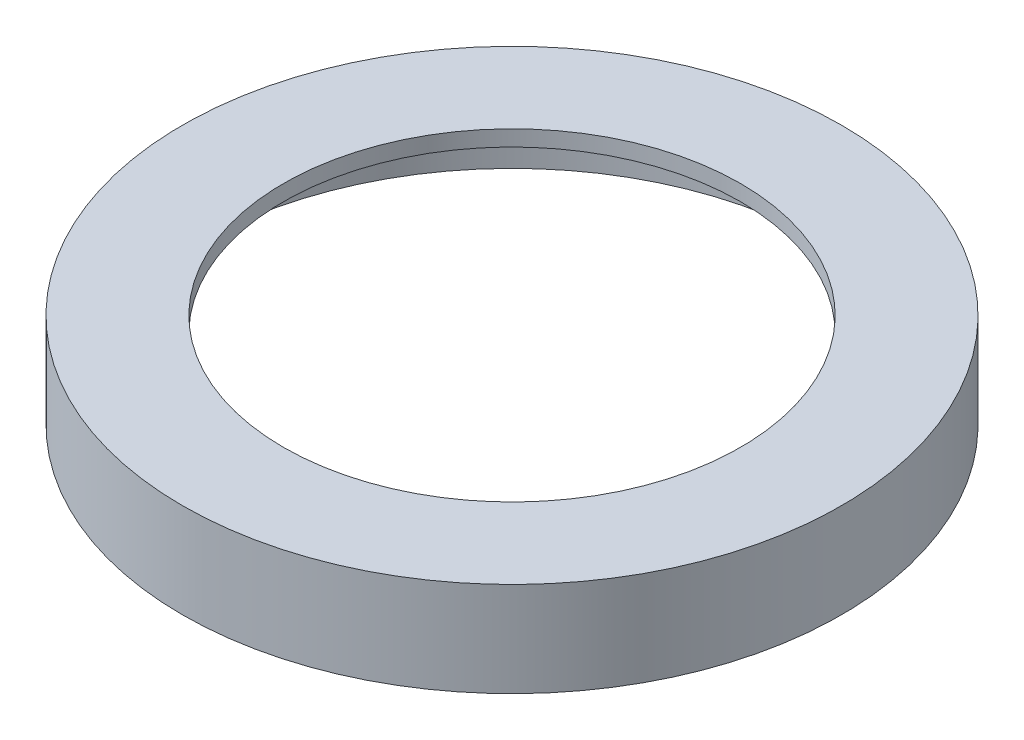
ISO-10303-21;
HEADER;
FILE_DESCRIPTION(('STEP AP214'),'2;1');
FILE_NAME('part.step','',(''),(''),'','','');
FILE_SCHEMA(('AUTOMOTIVE_DESIGN { 1 0 10303 214 1 1 1 1 }'));
ENDSEC;
DATA;
#1=APPLICATION_CONTEXT('core data for automotive mechanical design processes');
#2=APPLICATION_PROTOCOL_DEFINITION('international standard','automotive_design',2000,#1);
#3=PRODUCT_CONTEXT('',#1,'mechanical');
#4=PRODUCT('Part','Part','',(#3));
#5=PRODUCT_RELATED_PRODUCT_CATEGORY('part','',(#4));
#6=PRODUCT_DEFINITION_FORMATION('','',#4);
#7=PRODUCT_DEFINITION_CONTEXT('part definition',#1,'design');
#8=PRODUCT_DEFINITION('design','',#6,#7);
#9=PRODUCT_DEFINITION_SHAPE('','',#8);
#10=(LENGTH_UNIT() NAMED_UNIT(*) SI_UNIT(.MILLI.,.METRE.));
#11=(NAMED_UNIT(*) PLANE_ANGLE_UNIT() SI_UNIT($,.RADIAN.));
#12=(NAMED_UNIT(*) SI_UNIT($,.STERADIAN.) SOLID_ANGLE_UNIT());
#13=UNCERTAINTY_MEASURE_WITH_UNIT(LENGTH_MEASURE(1.E-05),#10,'distance_accuracy_value','');
#14=(GEOMETRIC_REPRESENTATION_CONTEXT(3) GLOBAL_UNCERTAINTY_ASSIGNED_CONTEXT((#13)) GLOBAL_UNIT_ASSIGNED_CONTEXT((#10,
#11,#12)) REPRESENTATION_CONTEXT('',''));
#15=CARTESIAN_POINT('',(0.,0.,0.));
#16=DIRECTION('',(0.,0.,1.));
#17=DIRECTION('',(1.,0.,0.));
#18=AXIS2_PLACEMENT_3D('',#15,#16,#17);
#19=CARTESIAN_POINT('',(0.,0.,0.));
#20=DIRECTION('',(0.,1.,0.));
#21=DIRECTION('',(0.,0.,1.));
#22=AXIS2_PLACEMENT_3D('',#19,#20,#21);
#23=PLANE('',#22);
#24=CARTESIAN_POINT('',(0.,0.,0.));
#25=DIRECTION('',(0.,1.,0.));
#26=DIRECTION('',(0.,0.,1.));
#27=AXIS2_PLACEMENT_3D('',#24,#25,#26);
#28=CIRCLE('',#27,53.1114);
#29=CARTESIAN_POINT('',(0.,0.,53.1114));
#30=VERTEX_POINT('',#29);
#31=EDGE_CURVE('E10',#30,#30,#28,.T.);
#32=ORIENTED_EDGE('',*,*,#31,.F.);
#33=EDGE_LOOP('',(#32));
#34=FACE_BOUND('',#33,.T.);
#35=CARTESIAN_POINT('',(0.,0.,0.));
#36=DIRECTION('',(0.,1.,0.));
#37=DIRECTION('',(0.,0.,1.));
#38=AXIS2_PLACEMENT_3D('',#35,#36,#37);
#39=CIRCLE('',#38,50.5714);
#40=CARTESIAN_POINT('',(0.,0.,50.5714));
#41=VERTEX_POINT('',#40);
#42=EDGE_CURVE('E38',#41,#41,#39,.T.);
#43=ORIENTED_EDGE('',*,*,#42,.T.);
#44=EDGE_LOOP('',(#43));
#45=FACE_BOUND('',#44,.T.);
#46=ADVANCED_FACE('F31',(#34,#45),#23,.F.);
#47=CARTESIAN_POINT('',(0.,12.7,0.));
#48=DIRECTION('',(0.,-1.,0.));
#49=DIRECTION('',(0.,0.,-1.));
#50=AXIS2_PLACEMENT_3D('',#47,#48,#49);
#51=CYLINDRICAL_SURFACE('',#50,53.1114);
#52=ORIENTED_EDGE('',*,*,#31,.T.);
#53=EDGE_LOOP('',(#52));
#54=FACE_BOUND('',#53,.T.);
#55=CARTESIAN_POINT('',(0.,15.24,0.));
#56=DIRECTION('',(0.,1.,0.));
#57=DIRECTION('',(0.,0.,1.));
#58=AXIS2_PLACEMENT_3D('',#55,#56,#57);
#59=CIRCLE('',#58,53.1114);
#60=CARTESIAN_POINT('',(0.,15.24,53.1114));
#61=VERTEX_POINT('',#60);
#62=EDGE_CURVE('E46',#61,#61,#59,.T.);
#63=ORIENTED_EDGE('',*,*,#62,.F.);
#64=EDGE_LOOP('',(#63));
#65=FACE_BOUND('',#64,.T.);
#66=ADVANCED_FACE('F33',(#54,#65),#51,.T.);
#67=CARTESIAN_POINT('',(0.,12.7,0.));
#68=DIRECTION('',(0.,-1.,0.));
#69=DIRECTION('',(0.,0.,-1.));
#70=AXIS2_PLACEMENT_3D('',#67,#68,#69);
#71=CYLINDRICAL_SURFACE('',#70,50.5714);
#72=CARTESIAN_POINT('',(0.,12.7,0.));
#73=DIRECTION('',(0.,1.,0.));
#74=DIRECTION('',(0.,0.,1.));
#75=AXIS2_PLACEMENT_3D('',#72,#73,#74);
#76=CIRCLE('',#75,50.5714);
#77=CARTESIAN_POINT('',(0.,12.7,50.5714));
#78=VERTEX_POINT('',#77);
#79=EDGE_CURVE('E42',#78,#78,#76,.T.);
#80=ORIENTED_EDGE('',*,*,#79,.T.);
#81=EDGE_LOOP('',(#80));
#82=FACE_BOUND('',#81,.T.);
#83=ORIENTED_EDGE('',*,*,#42,.F.);
#84=EDGE_LOOP('',(#83));
#85=FACE_BOUND('',#84,.T.);
#86=ADVANCED_FACE('F71',(#82,#85),#71,.F.);
#87=CARTESIAN_POINT('',(0.,12.7,0.));
#88=DIRECTION('',(0.,1.,0.));
#89=DIRECTION('',(0.,0.,1.));
#90=AXIS2_PLACEMENT_3D('',#87,#88,#89);
#91=PLANE('',#90);
#92=CARTESIAN_POINT('',(0.,12.7,0.));
#93=DIRECTION('',(0.,1.,0.));
#94=DIRECTION('',(0.,0.,1.));
#95=AXIS2_PLACEMENT_3D('',#92,#93,#94);
#96=CIRCLE('',#95,36.83);
#97=CARTESIAN_POINT('',(0.,12.7,36.83));
#98=VERTEX_POINT('',#97);
#99=EDGE_CURVE('E52',#98,#98,#96,.T.);
#100=ORIENTED_EDGE('',*,*,#99,.T.);
#101=EDGE_LOOP('',(#100));
#102=FACE_BOUND('',#101,.T.);
#103=ORIENTED_EDGE('',*,*,#79,.F.);
#104=EDGE_LOOP('',(#103));
#105=FACE_BOUND('',#104,.T.);
#106=ADVANCED_FACE('F63',(#102,#105),#91,.F.);
#107=CARTESIAN_POINT('',(0.,15.24,0.));
#108=DIRECTION('',(0.,1.,0.));
#109=DIRECTION('',(0.,0.,1.));
#110=AXIS2_PLACEMENT_3D('',#107,#108,#109);
#111=PLANE('',#110);
#112=ORIENTED_EDGE('',*,*,#62,.T.);
#113=EDGE_LOOP('',(#112));
#114=FACE_BOUND('',#113,.T.);
#115=CARTESIAN_POINT('',(0.,15.24,0.));
#116=DIRECTION('',(0.,1.,0.));
#117=DIRECTION('',(0.,0.,1.));
#118=AXIS2_PLACEMENT_3D('',#115,#116,#117);
#119=CIRCLE('',#118,36.83);
#120=CARTESIAN_POINT('',(0.,15.24,36.83));
#121=VERTEX_POINT('',#120);
#122=EDGE_CURVE('E51',#121,#121,#119,.T.);
#123=ORIENTED_EDGE('',*,*,#122,.F.);
#124=EDGE_LOOP('',(#123));
#125=FACE_BOUND('',#124,.T.);
#126=ADVANCED_FACE('F61',(#114,#125),#111,.T.);
#127=CARTESIAN_POINT('',(0.,15.24,0.));
#128=DIRECTION('',(0.,-1.,0.));
#129=DIRECTION('',(0.,0.,-1.));
#130=AXIS2_PLACEMENT_3D('',#127,#128,#129);
#131=CYLINDRICAL_SURFACE('',#130,36.83);
#132=ORIENTED_EDGE('',*,*,#122,.T.);
#133=EDGE_LOOP('',(#132));
#134=FACE_BOUND('',#133,.T.);
#135=ORIENTED_EDGE('',*,*,#99,.F.);
#136=EDGE_LOOP('',(#135));
#137=FACE_BOUND('',#136,.T.);
#138=ADVANCED_FACE('F58',(#134,#137),#131,.F.);
#139=CLOSED_SHELL('',(#46,#66,#86,#106,#126,#138));
#140=MANIFOLD_SOLID_BREP('B2',#139);
#141=ADVANCED_BREP_SHAPE_REPRESENTATION('',(#18,#140),#14);
#142=SHAPE_DEFINITION_REPRESENTATION(#9,#141);
ENDSEC;
END-ISO-10303-21;
